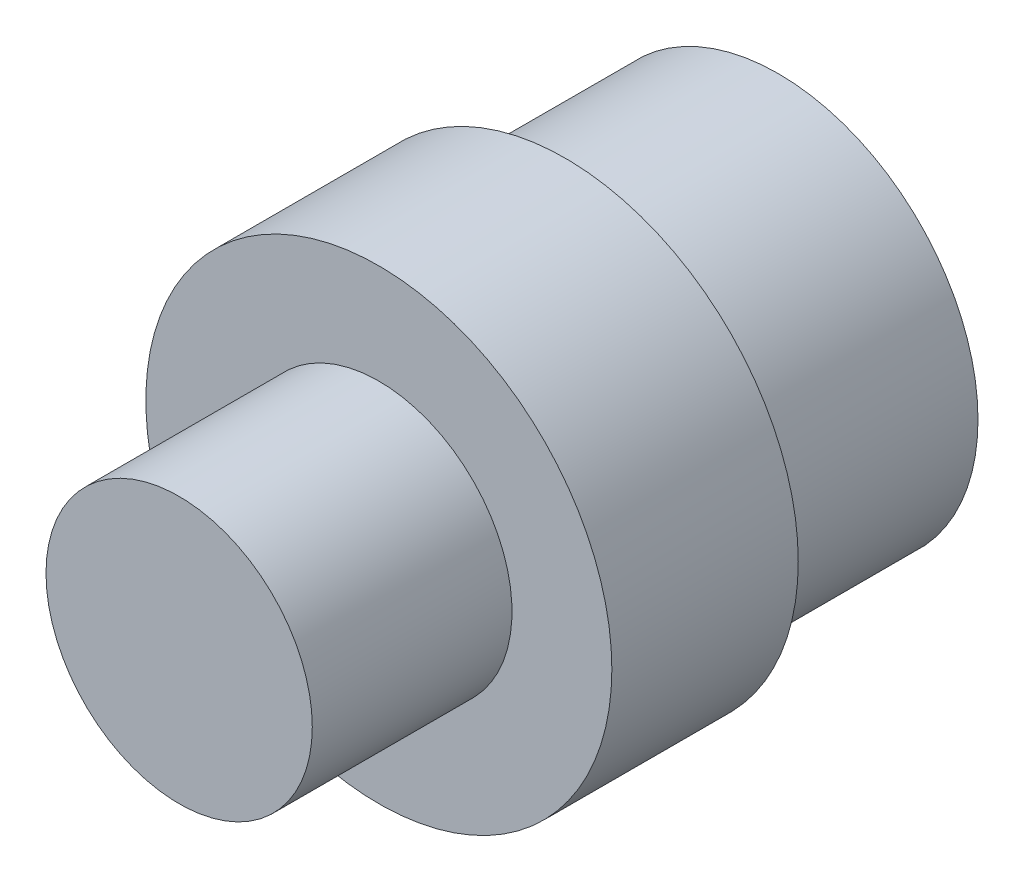
ISO-10303-21;
HEADER;
FILE_DESCRIPTION(('STEP AP214'),'2;1');
FILE_NAME('part.step','',(''),(''),'','','');
FILE_SCHEMA(('AUTOMOTIVE_DESIGN { 1 0 10303 214 1 1 1 1 }'));
ENDSEC;
DATA;
#1=APPLICATION_CONTEXT('core data for automotive mechanical design processes');
#2=APPLICATION_PROTOCOL_DEFINITION('international standard','automotive_design',2000,#1);
#3=PRODUCT_CONTEXT('',#1,'mechanical');
#4=PRODUCT('Part','Part','',(#3));
#5=PRODUCT_RELATED_PRODUCT_CATEGORY('part','',(#4));
#6=PRODUCT_DEFINITION_FORMATION('','',#4);
#7=PRODUCT_DEFINITION_CONTEXT('part definition',#1,'design');
#8=PRODUCT_DEFINITION('design','',#6,#7);
#9=PRODUCT_DEFINITION_SHAPE('','',#8);
#10=(LENGTH_UNIT() NAMED_UNIT(*) SI_UNIT(.MILLI.,.METRE.));
#11=(NAMED_UNIT(*) PLANE_ANGLE_UNIT() SI_UNIT($,.RADIAN.));
#12=(NAMED_UNIT(*) SI_UNIT($,.STERADIAN.) SOLID_ANGLE_UNIT());
#13=UNCERTAINTY_MEASURE_WITH_UNIT(LENGTH_MEASURE(1.E-05),#10,'distance_accuracy_value','');
#14=(GEOMETRIC_REPRESENTATION_CONTEXT(3) GLOBAL_UNCERTAINTY_ASSIGNED_CONTEXT((#13)) GLOBAL_UNIT_ASSIGNED_CONTEXT((#10,
#11,#12)) REPRESENTATION_CONTEXT('',''));
#15=CARTESIAN_POINT('',(0.,0.,0.));
#16=DIRECTION('',(0.,0.,1.));
#17=DIRECTION('',(1.,0.,0.));
#18=AXIS2_PLACEMENT_3D('',#15,#16,#17);
#19=CARTESIAN_POINT('',(0.,0.,9.525));
#20=DIRECTION('',(0.,0.,-1.));
#21=DIRECTION('',(-1.,0.,0.));
#22=AXIS2_PLACEMENT_3D('',#19,#20,#21);
#23=CYLINDRICAL_SURFACE('',#22,6.35);
#24=CARTESIAN_POINT('',(0.,0.,9.525));
#25=DIRECTION('',(0.,0.,1.));
#26=DIRECTION('',(1.,0.,0.));
#27=AXIS2_PLACEMENT_3D('',#24,#25,#26);
#28=CIRCLE('',#27,6.35);
#29=CARTESIAN_POINT('',(6.35,0.,9.525));
#30=VERTEX_POINT('',#29);
#31=EDGE_CURVE('E51',#30,#30,#28,.T.);
#32=ORIENTED_EDGE('',*,*,#31,.F.);
#33=EDGE_LOOP('',(#32));
#34=FACE_BOUND('',#33,.T.);
#35=CARTESIAN_POINT('',(0.,0.,0.));
#36=DIRECTION('',(0.,0.,-1.));
#37=DIRECTION('',(-1.,0.,0.));
#38=AXIS2_PLACEMENT_3D('',#35,#36,#37);
#39=CIRCLE('',#38,6.35);
#40=CARTESIAN_POINT('',(-6.35,0.,0.));
#41=VERTEX_POINT('',#40);
#42=EDGE_CURVE('E55',#41,#41,#39,.T.);
#43=ORIENTED_EDGE('',*,*,#42,.F.);
#44=EDGE_LOOP('',(#43));
#45=FACE_BOUND('',#44,.T.);
#46=ADVANCED_FACE('F45',(#34,#45),#23,.T.);
#47=CARTESIAN_POINT('',(0.,0.,9.525));
#48=DIRECTION('',(0.,0.,1.));
#49=DIRECTION('',(1.,0.,0.));
#50=AXIS2_PLACEMENT_3D('',#47,#48,#49);
#51=PLANE('',#50);
#52=ORIENTED_EDGE('',*,*,#31,.T.);
#53=EDGE_LOOP('',(#52));
#54=FACE_BOUND('',#53,.T.);
#55=ADVANCED_FACE('F90',(#54),#51,.T.);
#56=CARTESIAN_POINT('',(0.,0.,0.));
#57=DIRECTION('',(0.,0.,-1.));
#58=DIRECTION('',(-1.,0.,0.));
#59=AXIS2_PLACEMENT_3D('',#56,#57,#58);
#60=PLANE('',#59);
#61=ORIENTED_EDGE('',*,*,#42,.T.);
#62=EDGE_LOOP('',(#61));
#63=FACE_BOUND('',#62,.T.);
#64=CARTESIAN_POINT('',(0.,0.,0.));
#65=DIRECTION('',(0.,0.,1.));
#66=DIRECTION('',(1.,0.,0.));
#67=AXIS2_PLACEMENT_3D('',#64,#65,#66);
#68=CIRCLE('',#67,11.1125);
#69=CARTESIAN_POINT('',(11.1125,0.,0.));
#70=VERTEX_POINT('',#69);
#71=EDGE_CURVE('E67',#70,#70,#68,.T.);
#72=ORIENTED_EDGE('',*,*,#71,.T.);
#73=EDGE_LOOP('',(#72));
#74=FACE_BOUND('',#73,.T.);
#75=ADVANCED_FACE('F71',(#63,#74),#60,.F.);
#76=CARTESIAN_POINT('',(0.,0.,-8.89));
#77=DIRECTION('',(0.,0.,1.));
#78=DIRECTION('',(1.,0.,0.));
#79=AXIS2_PLACEMENT_3D('',#76,#77,#78);
#80=PLANE('',#79);
#81=CARTESIAN_POINT('',(0.,0.,-8.89));
#82=DIRECTION('',(0.,0.,1.));
#83=DIRECTION('',(1.,0.,0.));
#84=AXIS2_PLACEMENT_3D('',#81,#82,#83);
#85=CIRCLE('',#84,11.1125);
#86=CARTESIAN_POINT('',(11.1125,0.,-8.89));
#87=VERTEX_POINT('',#86);
#88=EDGE_CURVE('E64',#87,#87,#85,.T.);
#89=ORIENTED_EDGE('',*,*,#88,.F.);
#90=EDGE_LOOP('',(#89));
#91=FACE_BOUND('',#90,.T.);
#92=CARTESIAN_POINT('',(0.,0.,-8.89));
#93=DIRECTION('',(0.,0.,1.));
#94=DIRECTION('',(1.,0.,0.));
#95=AXIS2_PLACEMENT_3D('',#92,#93,#94);
#96=CIRCLE('',#95,9.525);
#97=CARTESIAN_POINT('',(9.525,0.,-8.89));
#98=VERTEX_POINT('',#97);
#99=EDGE_CURVE('E12',#98,#98,#96,.T.);
#100=ORIENTED_EDGE('',*,*,#99,.T.);
#101=EDGE_LOOP('',(#100));
#102=FACE_BOUND('',#101,.T.);
#103=ADVANCED_FACE('F76',(#91,#102),#80,.F.);
#104=CARTESIAN_POINT('',(0.,0.,-8.89));
#105=DIRECTION('',(0.,0.,1.));
#106=DIRECTION('',(1.,0.,0.));
#107=AXIS2_PLACEMENT_3D('',#104,#105,#106);
#108=CYLINDRICAL_SURFACE('',#107,11.1125);
#109=ORIENTED_EDGE('',*,*,#88,.T.);
#110=EDGE_LOOP('',(#109));
#111=FACE_BOUND('',#110,.T.);
#112=ORIENTED_EDGE('',*,*,#71,.F.);
#113=EDGE_LOOP('',(#112));
#114=FACE_BOUND('',#113,.T.);
#115=ADVANCED_FACE('F73',(#111,#114),#108,.T.);
#116=CARTESIAN_POINT('',(0.,0.,-19.05));
#117=DIRECTION('',(0.,0.,-1.));
#118=DIRECTION('',(-1.,0.,0.));
#119=AXIS2_PLACEMENT_3D('',#116,#117,#118);
#120=PLANE('',#119);
#121=CARTESIAN_POINT('',(0.,0.,-19.05));
#122=DIRECTION('',(0.,0.,-1.));
#123=DIRECTION('',(-1.,0.,0.));
#124=AXIS2_PLACEMENT_3D('',#121,#122,#123);
#125=CIRCLE('',#124,9.525);
#126=CARTESIAN_POINT('',(-9.525,0.,-19.05));
#127=VERTEX_POINT('',#126);
#128=EDGE_CURVE('E59',#127,#127,#125,.T.);
#129=ORIENTED_EDGE('',*,*,#128,.T.);
#130=EDGE_LOOP('',(#129));
#131=FACE_BOUND('',#130,.T.);
#132=ADVANCED_FACE('F75',(#131),#120,.T.);
#133=CARTESIAN_POINT('',(0.,0.,-19.05));
#134=DIRECTION('',(0.,0.,1.));
#135=DIRECTION('',(1.,0.,0.));
#136=AXIS2_PLACEMENT_3D('',#133,#134,#135);
#137=CYLINDRICAL_SURFACE('',#136,9.525);
#138=ORIENTED_EDGE('',*,*,#128,.F.);
#139=EDGE_LOOP('',(#138));
#140=FACE_BOUND('',#139,.T.);
#141=ORIENTED_EDGE('',*,*,#99,.F.);
#142=EDGE_LOOP('',(#141));
#143=FACE_BOUND('',#142,.T.);
#144=ADVANCED_FACE('F83',(#140,#143),#137,.T.);
#145=CLOSED_SHELL('',(#46,#55,#75,#103,#115,#132,#144));
#146=MANIFOLD_SOLID_BREP('B2',#145);
#147=ADVANCED_BREP_SHAPE_REPRESENTATION('',(#18,#146),#14);
#148=SHAPE_DEFINITION_REPRESENTATION(#9,#147);
ENDSEC;
END-ISO-10303-21;
